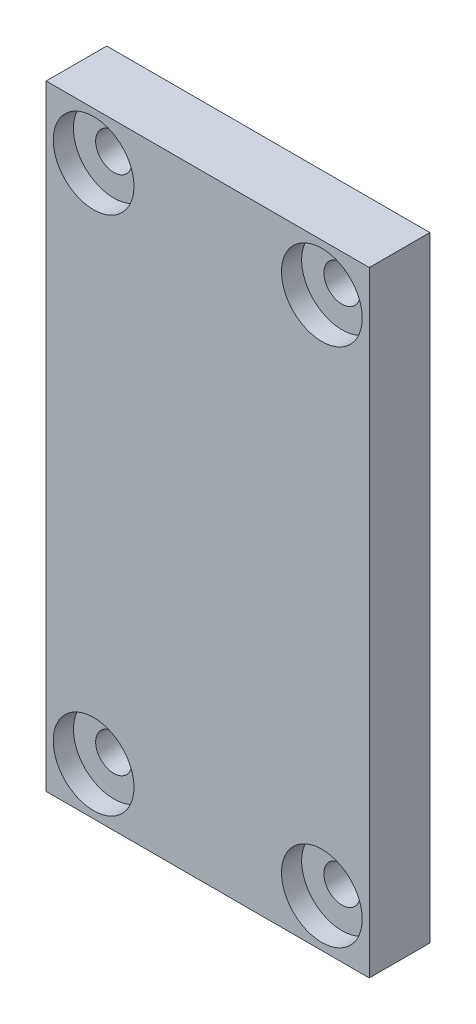
ISO-10303-21;
HEADER;
FILE_DESCRIPTION(('STEP AP214'),'2;1');
FILE_NAME('part.step','',(''),(''),'','','');
FILE_SCHEMA(('AUTOMOTIVE_DESIGN { 1 0 10303 214 1 1 1 1 }'));
ENDSEC;
DATA;
#1=APPLICATION_CONTEXT('core data for automotive mechanical design processes');
#2=APPLICATION_PROTOCOL_DEFINITION('international standard','automotive_design',2000,#1);
#3=PRODUCT_CONTEXT('',#1,'mechanical');
#4=PRODUCT('Part','Part','',(#3));
#5=PRODUCT_RELATED_PRODUCT_CATEGORY('part','',(#4));
#6=PRODUCT_DEFINITION_FORMATION('','',#4);
#7=PRODUCT_DEFINITION_CONTEXT('part definition',#1,'design');
#8=PRODUCT_DEFINITION('design','',#6,#7);
#9=PRODUCT_DEFINITION_SHAPE('','',#8);
#10=(LENGTH_UNIT() NAMED_UNIT(*) SI_UNIT(.MILLI.,.METRE.));
#11=(NAMED_UNIT(*) PLANE_ANGLE_UNIT() SI_UNIT($,.RADIAN.));
#12=(NAMED_UNIT(*) SI_UNIT($,.STERADIAN.) SOLID_ANGLE_UNIT());
#13=UNCERTAINTY_MEASURE_WITH_UNIT(LENGTH_MEASURE(1.E-05),#10,'distance_accuracy_value','');
#14=(GEOMETRIC_REPRESENTATION_CONTEXT(3) GLOBAL_UNCERTAINTY_ASSIGNED_CONTEXT((#13)) GLOBAL_UNIT_ASSIGNED_CONTEXT((#10,
#11,#12)) REPRESENTATION_CONTEXT('',''));
#15=CARTESIAN_POINT('',(0.,0.,0.));
#16=DIRECTION('',(0.,0.,1.));
#17=DIRECTION('',(1.,0.,0.));
#18=AXIS2_PLACEMENT_3D('',#15,#16,#17);
#19=CARTESIAN_POINT('',(11.9174159408387,12.8899999999994,3.));
#20=DIRECTION('',(0.,0.,-1.));
#21=DIRECTION('',(-1.,0.,0.));
#22=AXIS2_PLACEMENT_3D('',#19,#20,#21);
#23=CYLINDRICAL_SURFACE('',#22,0.899999977999999);
#24=CARTESIAN_POINT('',(11.9174159408387,12.8899999999994,0.));
#25=DIRECTION('',(0.,0.,1.));
#26=DIRECTION('',(1.,0.,0.));
#27=AXIS2_PLACEMENT_3D('',#24,#25,#26);
#28=CIRCLE('',#27,0.899999977999999);
#29=CARTESIAN_POINT('',(12.8174159188387,12.8899999999994,0.));
#30=VERTEX_POINT('',#29);
#31=EDGE_CURVE('E139',#30,#30,#28,.T.);
#32=ORIENTED_EDGE('',*,*,#31,.F.);
#33=EDGE_LOOP('',(#32));
#34=FACE_BOUND('',#33,.T.);
#35=CARTESIAN_POINT('',(11.9174159408387,12.8899999999994,2.));
#36=DIRECTION('',(0.,0.,1.));
#37=DIRECTION('',(1.,0.,0.));
#38=AXIS2_PLACEMENT_3D('',#35,#36,#37);
#39=CIRCLE('',#38,0.899999977999999);
#40=CARTESIAN_POINT('',(12.8174159188387,12.8899999999994,2.));
#41=VERTEX_POINT('',#40);
#42=EDGE_CURVE('E46',#41,#41,#39,.T.);
#43=ORIENTED_EDGE('',*,*,#42,.T.);
#44=EDGE_LOOP('',(#43));
#45=FACE_BOUND('',#44,.T.);
#46=ADVANCED_FACE('F42',(#34,#45),#23,.F.);
#47=CARTESIAN_POINT('',(23.2239221643566,-12.8900000000008,3.));
#48=DIRECTION('',(0.,0.,-1.));
#49=DIRECTION('',(-1.,0.,0.));
#50=AXIS2_PLACEMENT_3D('',#47,#48,#49);
#51=CYLINDRICAL_SURFACE('',#50,0.899999977999999);
#52=CARTESIAN_POINT('',(23.2239221643566,-12.8900000000008,0.));
#53=DIRECTION('',(0.,0.,1.));
#54=DIRECTION('',(1.,0.,0.));
#55=AXIS2_PLACEMENT_3D('',#52,#53,#54);
#56=CIRCLE('',#55,0.899999977999999);
#57=CARTESIAN_POINT('',(24.1239221423566,-12.8900000000008,0.));
#58=VERTEX_POINT('',#57);
#59=EDGE_CURVE('E135',#58,#58,#56,.T.);
#60=ORIENTED_EDGE('',*,*,#59,.F.);
#61=EDGE_LOOP('',(#60));
#62=FACE_BOUND('',#61,.T.);
#63=CARTESIAN_POINT('',(23.2239221643566,-12.8900000000008,2.));
#64=DIRECTION('',(0.,0.,1.));
#65=DIRECTION('',(1.,0.,0.));
#66=AXIS2_PLACEMENT_3D('',#63,#64,#65);
#67=CIRCLE('',#66,0.899999977999999);
#68=CARTESIAN_POINT('',(24.1239221423566,-12.8900000000008,2.));
#69=VERTEX_POINT('',#68);
#70=EDGE_CURVE('E164',#69,#69,#67,.T.);
#71=ORIENTED_EDGE('',*,*,#70,.T.);
#72=EDGE_LOOP('',(#71));
#73=FACE_BOUND('',#72,.T.);
#74=ADVANCED_FACE('F251',(#62,#73),#51,.F.);
#75=CARTESIAN_POINT('',(23.2239221643566,12.8899999999994,3.));
#76=DIRECTION('',(0.,0.,-1.));
#77=DIRECTION('',(-1.,0.,0.));
#78=AXIS2_PLACEMENT_3D('',#75,#76,#77);
#79=CYLINDRICAL_SURFACE('',#78,0.899999977999999);
#80=CARTESIAN_POINT('',(23.2239221643566,12.8899999999994,0.));
#81=DIRECTION('',(0.,0.,1.));
#82=DIRECTION('',(1.,0.,0.));
#83=AXIS2_PLACEMENT_3D('',#80,#81,#82);
#84=CIRCLE('',#83,0.899999977999999);
#85=CARTESIAN_POINT('',(24.1239221423566,12.8899999999994,0.));
#86=VERTEX_POINT('',#85);
#87=EDGE_CURVE('E132',#86,#86,#84,.T.);
#88=ORIENTED_EDGE('',*,*,#87,.F.);
#89=EDGE_LOOP('',(#88));
#90=FACE_BOUND('',#89,.T.);
#91=CARTESIAN_POINT('',(23.2239221643566,12.8899999999994,2.));
#92=DIRECTION('',(0.,0.,1.));
#93=DIRECTION('',(1.,0.,0.));
#94=AXIS2_PLACEMENT_3D('',#91,#92,#93);
#95=CIRCLE('',#94,0.899999977999999);
#96=CARTESIAN_POINT('',(24.1239221423566,12.8899999999994,2.));
#97=VERTEX_POINT('',#96);
#98=EDGE_CURVE('E160',#97,#97,#95,.T.);
#99=ORIENTED_EDGE('',*,*,#98,.T.);
#100=EDGE_LOOP('',(#99));
#101=FACE_BOUND('',#100,.T.);
#102=ADVANCED_FACE('F257',(#90,#101),#79,.F.);
#103=CARTESIAN_POINT('',(11.9174159408387,-12.8900000000008,3.));
#104=DIRECTION('',(0.,0.,-1.));
#105=DIRECTION('',(-1.,0.,0.));
#106=AXIS2_PLACEMENT_3D('',#103,#104,#105);
#107=CYLINDRICAL_SURFACE('',#106,0.899999977999999);
#108=CARTESIAN_POINT('',(11.9174159408387,-12.8900000000008,0.));
#109=DIRECTION('',(0.,0.,1.));
#110=DIRECTION('',(1.,0.,0.));
#111=AXIS2_PLACEMENT_3D('',#108,#109,#110);
#112=CIRCLE('',#111,0.899999977999999);
#113=CARTESIAN_POINT('',(12.8174159188387,-12.8900000000008,0.));
#114=VERTEX_POINT('',#113);
#115=EDGE_CURVE('E128',#114,#114,#112,.T.);
#116=ORIENTED_EDGE('',*,*,#115,.F.);
#117=EDGE_LOOP('',(#116));
#118=FACE_BOUND('',#117,.T.);
#119=CARTESIAN_POINT('',(11.9174159408387,-12.8900000000008,2.));
#120=DIRECTION('',(0.,0.,1.));
#121=DIRECTION('',(1.,0.,0.));
#122=AXIS2_PLACEMENT_3D('',#119,#120,#121);
#123=CIRCLE('',#122,0.899999977999999);
#124=CARTESIAN_POINT('',(12.8174159188387,-12.8900000000008,2.));
#125=VERTEX_POINT('',#124);
#126=EDGE_CURVE('E156',#125,#125,#123,.T.);
#127=ORIENTED_EDGE('',*,*,#126,.T.);
#128=EDGE_LOOP('',(#127));
#129=FACE_BOUND('',#128,.T.);
#130=ADVANCED_FACE('F44',(#118,#129),#107,.F.);
#131=CARTESIAN_POINT('',(25.5739221643566,0.,3.));
#132=DIRECTION('',(1.,0.,0.));
#133=DIRECTION('',(0.,0.,-1.));
#134=AXIS2_PLACEMENT_3D('',#131,#132,#133);
#135=PLANE('',#134);
#136=DIRECTION('',(0.,-1.,0.));
#137=VECTOR('',#136,1.);
#138=CARTESIAN_POINT('',(25.5739221643566,0.,0.));
#139=LINE('',#138,#137);
#140=CARTESIAN_POINT('',(25.5739221643566,15.2399999999994,0.));
#141=VERTEX_POINT('',#140);
#142=CARTESIAN_POINT('',(25.5739221643566,-15.2400000000008,0.));
#143=VERTEX_POINT('',#142);
#144=EDGE_CURVE('E143',#141,#143,#139,.T.);
#145=ORIENTED_EDGE('',*,*,#144,.F.);
#146=DIRECTION('',(0.,0.,-1.));
#147=VECTOR('',#146,1.);
#148=CARTESIAN_POINT('',(25.5739221643566,15.2399999999994,3.));
#149=LINE('',#148,#147);
#150=CARTESIAN_POINT('',(25.5739221643566,15.2399999999994,3.));
#151=VERTEX_POINT('',#150);
#152=EDGE_CURVE('E11',#151,#141,#149,.T.);
#153=ORIENTED_EDGE('',*,*,#152,.F.);
#154=DIRECTION('',(0.,-1.,0.));
#155=VECTOR('',#154,1.);
#156=CARTESIAN_POINT('',(25.5739221643566,0.,3.));
#157=LINE('',#156,#155);
#158=CARTESIAN_POINT('',(25.5739221643566,-15.2400000000008,3.));
#159=VERTEX_POINT('',#158);
#160=EDGE_CURVE('E117',#151,#159,#157,.T.);
#161=ORIENTED_EDGE('',*,*,#160,.T.);
#162=DIRECTION('',(0.,0.,-1.));
#163=VECTOR('',#162,1.);
#164=CARTESIAN_POINT('',(25.5739221643566,-15.2400000000008,3.));
#165=LINE('',#164,#163);
#166=EDGE_CURVE('E92',#159,#143,#165,.T.);
#167=ORIENTED_EDGE('',*,*,#166,.T.);
#168=EDGE_LOOP('',(#145,#153,#161,#167));
#169=FACE_BOUND('',#168,.T.);
#170=ADVANCED_FACE('F262',(#169),#135,.T.);
#171=CARTESIAN_POINT('',(0.,15.2399999999994,3.));
#172=DIRECTION('',(0.,1.,0.));
#173=DIRECTION('',(0.,0.,1.));
#174=AXIS2_PLACEMENT_3D('',#171,#172,#173);
#175=PLANE('',#174);
#176=DIRECTION('',(1.,0.,0.));
#177=VECTOR('',#176,1.);
#178=CARTESIAN_POINT('',(0.,15.2399999999994,0.));
#179=LINE('',#178,#177);
#180=CARTESIAN_POINT('',(9.56741594083871,15.2399999999994,0.));
#181=VERTEX_POINT('',#180);
#182=EDGE_CURVE('E105',#181,#141,#179,.T.);
#183=ORIENTED_EDGE('',*,*,#182,.F.);
#184=DIRECTION('',(0.,0.,-1.));
#185=VECTOR('',#184,1.);
#186=CARTESIAN_POINT('',(9.56741594083871,15.2399999999994,3.));
#187=LINE('',#186,#185);
#188=CARTESIAN_POINT('',(9.56741594083871,15.2399999999994,3.));
#189=VERTEX_POINT('',#188);
#190=EDGE_CURVE('E53',#189,#181,#187,.T.);
#191=ORIENTED_EDGE('',*,*,#190,.F.);
#192=DIRECTION('',(1.,0.,0.));
#193=VECTOR('',#192,1.);
#194=CARTESIAN_POINT('',(0.,15.2399999999994,3.));
#195=LINE('',#194,#193);
#196=EDGE_CURVE('E103',#189,#151,#195,.T.);
#197=ORIENTED_EDGE('',*,*,#196,.T.);
#198=ORIENTED_EDGE('',*,*,#152,.T.);
#199=EDGE_LOOP('',(#183,#191,#197,#198));
#200=FACE_BOUND('',#199,.T.);
#201=ADVANCED_FACE('F101',(#200),#175,.T.);
#202=CARTESIAN_POINT('',(9.56741594083871,0.,3.));
#203=DIRECTION('',(1.,0.,0.));
#204=DIRECTION('',(0.,0.,-1.));
#205=AXIS2_PLACEMENT_3D('',#202,#203,#204);
#206=PLANE('',#205);
#207=DIRECTION('',(0.,-1.,0.));
#208=VECTOR('',#207,1.);
#209=CARTESIAN_POINT('',(9.56741594083871,0.,0.));
#210=LINE('',#209,#208);
#211=CARTESIAN_POINT('',(9.56741594083871,-15.2400000000008,0.));
#212=VERTEX_POINT('',#211);
#213=EDGE_CURVE('E147',#181,#212,#210,.T.);
#214=ORIENTED_EDGE('',*,*,#213,.T.);
#215=DIRECTION('',(0.,0.,-1.));
#216=VECTOR('',#215,1.);
#217=CARTESIAN_POINT('',(9.56741594083871,-15.2400000000008,3.));
#218=LINE('',#217,#216);
#219=CARTESIAN_POINT('',(9.56741594083871,-15.2400000000008,3.));
#220=VERTEX_POINT('',#219);
#221=EDGE_CURVE('E109',#220,#212,#218,.T.);
#222=ORIENTED_EDGE('',*,*,#221,.F.);
#223=DIRECTION('',(0.,-1.,0.));
#224=VECTOR('',#223,1.);
#225=CARTESIAN_POINT('',(9.56741594083871,0.,3.));
#226=LINE('',#225,#224);
#227=EDGE_CURVE('E112',#189,#220,#226,.T.);
#228=ORIENTED_EDGE('',*,*,#227,.F.);
#229=ORIENTED_EDGE('',*,*,#190,.T.);
#230=EDGE_LOOP('',(#214,#222,#228,#229));
#231=FACE_BOUND('',#230,.T.);
#232=ADVANCED_FACE('F113',(#231),#206,.F.);
#233=CARTESIAN_POINT('',(0.,-15.2400000000008,3.));
#234=DIRECTION('',(0.,1.,0.));
#235=DIRECTION('',(0.,0.,1.));
#236=AXIS2_PLACEMENT_3D('',#233,#234,#235);
#237=PLANE('',#236);
#238=DIRECTION('',(1.,0.,0.));
#239=VECTOR('',#238,1.);
#240=CARTESIAN_POINT('',(0.,-15.2400000000008,0.));
#241=LINE('',#240,#239);
#242=EDGE_CURVE('E84',#212,#143,#241,.T.);
#243=ORIENTED_EDGE('',*,*,#242,.T.);
#244=ORIENTED_EDGE('',*,*,#166,.F.);
#245=DIRECTION('',(1.,0.,0.));
#246=VECTOR('',#245,1.);
#247=CARTESIAN_POINT('',(0.,-15.2400000000008,3.));
#248=LINE('',#247,#246);
#249=EDGE_CURVE('E65',#220,#159,#248,.T.);
#250=ORIENTED_EDGE('',*,*,#249,.F.);
#251=ORIENTED_EDGE('',*,*,#221,.T.);
#252=EDGE_LOOP('',(#243,#244,#250,#251));
#253=FACE_BOUND('',#252,.T.);
#254=ADVANCED_FACE('F229',(#253),#237,.F.);
#255=CARTESIAN_POINT('',(0.,0.,3.));
#256=DIRECTION('',(0.,0.,1.));
#257=DIRECTION('',(1.,0.,0.));
#258=AXIS2_PLACEMENT_3D('',#255,#256,#257);
#259=PLANE('',#258);
#260=CARTESIAN_POINT('',(11.9174159408387,12.8899999999994,3.));
#261=DIRECTION('',(0.,0.,1.));
#262=DIRECTION('',(1.,0.,0.));
#263=AXIS2_PLACEMENT_3D('',#260,#261,#262);
#264=CIRCLE('',#263,2.00000006399992);
#265=CARTESIAN_POINT('',(13.9174160048386,12.8899999999994,3.));
#266=VERTEX_POINT('',#265);
#267=EDGE_CURVE('E187',#266,#266,#264,.T.);
#268=ORIENTED_EDGE('',*,*,#267,.F.);
#269=EDGE_LOOP('',(#268));
#270=FACE_BOUND('',#269,.T.);
#271=CARTESIAN_POINT('',(11.9174159408387,-12.8900000000008,3.));
#272=DIRECTION('',(0.,0.,1.));
#273=DIRECTION('',(1.,0.,0.));
#274=AXIS2_PLACEMENT_3D('',#271,#272,#273);
#275=CIRCLE('',#274,2.00000006399992);
#276=CARTESIAN_POINT('',(13.9174160048386,-12.8900000000008,3.));
#277=VERTEX_POINT('',#276);
#278=EDGE_CURVE('E186',#277,#277,#275,.T.);
#279=ORIENTED_EDGE('',*,*,#278,.F.);
#280=EDGE_LOOP('',(#279));
#281=FACE_BOUND('',#280,.T.);
#282=CARTESIAN_POINT('',(23.2239221643566,-12.8900000000008,3.));
#283=DIRECTION('',(0.,0.,1.));
#284=DIRECTION('',(1.,0.,0.));
#285=AXIS2_PLACEMENT_3D('',#282,#283,#284);
#286=CIRCLE('',#285,2.00000006399992);
#287=CARTESIAN_POINT('',(25.2239222283565,-12.8900000000008,3.));
#288=VERTEX_POINT('',#287);
#289=EDGE_CURVE('E207',#288,#288,#286,.T.);
#290=ORIENTED_EDGE('',*,*,#289,.F.);
#291=EDGE_LOOP('',(#290));
#292=FACE_BOUND('',#291,.T.);
#293=CARTESIAN_POINT('',(23.2239221643566,12.8899999999994,3.));
#294=DIRECTION('',(0.,0.,1.));
#295=DIRECTION('',(1.,0.,0.));
#296=AXIS2_PLACEMENT_3D('',#293,#294,#295);
#297=CIRCLE('',#296,2.00000006399992);
#298=CARTESIAN_POINT('',(25.2239222283565,12.8899999999994,3.));
#299=VERTEX_POINT('',#298);
#300=EDGE_CURVE('E200',#299,#299,#297,.T.);
#301=ORIENTED_EDGE('',*,*,#300,.F.);
#302=EDGE_LOOP('',(#301));
#303=FACE_BOUND('',#302,.T.);
#304=ORIENTED_EDGE('',*,*,#160,.F.);
#305=ORIENTED_EDGE('',*,*,#196,.F.);
#306=ORIENTED_EDGE('',*,*,#227,.T.);
#307=ORIENTED_EDGE('',*,*,#249,.T.);
#308=EDGE_LOOP('',(#304,#305,#306,#307));
#309=FACE_BOUND('',#308,.T.);
#310=ADVANCED_FACE('F116',(#270,#281,#292,#303,#309),#259,.T.);
#311=CARTESIAN_POINT('',(0.,0.,0.));
#312=DIRECTION('',(0.,0.,1.));
#313=DIRECTION('',(1.,0.,0.));
#314=AXIS2_PLACEMENT_3D('',#311,#312,#313);
#315=PLANE('',#314);
#316=ORIENTED_EDGE('',*,*,#115,.T.);
#317=EDGE_LOOP('',(#316));
#318=FACE_BOUND('',#317,.T.);
#319=ORIENTED_EDGE('',*,*,#87,.T.);
#320=EDGE_LOOP('',(#319));
#321=FACE_BOUND('',#320,.T.);
#322=ORIENTED_EDGE('',*,*,#59,.T.);
#323=EDGE_LOOP('',(#322));
#324=FACE_BOUND('',#323,.T.);
#325=ORIENTED_EDGE('',*,*,#31,.T.);
#326=EDGE_LOOP('',(#325));
#327=FACE_BOUND('',#326,.T.);
#328=ORIENTED_EDGE('',*,*,#144,.T.);
#329=ORIENTED_EDGE('',*,*,#242,.F.);
#330=ORIENTED_EDGE('',*,*,#213,.F.);
#331=ORIENTED_EDGE('',*,*,#182,.T.);
#332=EDGE_LOOP('',(#328,#329,#330,#331));
#333=FACE_BOUND('',#332,.T.);
#334=ADVANCED_FACE('F228',(#318,#321,#324,#327,#333),#315,.F.);
#335=CARTESIAN_POINT('',(23.2239221643566,12.8899999999994,2.));
#336=DIRECTION('',(0.,0.,1.));
#337=DIRECTION('',(1.,0.,0.));
#338=AXIS2_PLACEMENT_3D('',#335,#336,#337);
#339=CYLINDRICAL_SURFACE('',#338,2.00000006399992);
#340=CARTESIAN_POINT('',(23.2239221643566,12.8899999999994,2.));
#341=DIRECTION('',(0.,0.,1.));
#342=DIRECTION('',(1.,0.,0.));
#343=AXIS2_PLACEMENT_3D('',#340,#341,#342);
#344=CIRCLE('',#343,2.00000006399992);
#345=CARTESIAN_POINT('',(25.2239222283565,12.8899999999994,2.));
#346=VERTEX_POINT('',#345);
#347=EDGE_CURVE('E161',#346,#346,#344,.T.);
#348=ORIENTED_EDGE('',*,*,#347,.F.);
#349=EDGE_LOOP('',(#348));
#350=FACE_BOUND('',#349,.T.);
#351=ORIENTED_EDGE('',*,*,#300,.T.);
#352=EDGE_LOOP('',(#351));
#353=FACE_BOUND('',#352,.T.);
#354=ADVANCED_FACE('F246',(#350,#353),#339,.F.);
#355=CARTESIAN_POINT('',(23.2239221643566,12.8899999999994,2.));
#356=DIRECTION('',(0.,0.,1.));
#357=DIRECTION('',(1.,0.,0.));
#358=AXIS2_PLACEMENT_3D('',#355,#356,#357);
#359=PLANE('',#358);
#360=ORIENTED_EDGE('',*,*,#98,.F.);
#361=EDGE_LOOP('',(#360));
#362=FACE_BOUND('',#361,.T.);
#363=ORIENTED_EDGE('',*,*,#347,.T.);
#364=EDGE_LOOP('',(#363));
#365=FACE_BOUND('',#364,.T.);
#366=ADVANCED_FACE('F237',(#362,#365),#359,.T.);
#367=CARTESIAN_POINT('',(23.2239221643566,-12.8900000000008,2.));
#368=DIRECTION('',(0.,0.,1.));
#369=DIRECTION('',(1.,0.,0.));
#370=AXIS2_PLACEMENT_3D('',#367,#368,#369);
#371=CYLINDRICAL_SURFACE('',#370,2.00000006399992);
#372=CARTESIAN_POINT('',(23.2239221643566,-12.8900000000008,2.));
#373=DIRECTION('',(0.,0.,1.));
#374=DIRECTION('',(1.,0.,0.));
#375=AXIS2_PLACEMENT_3D('',#372,#373,#374);
#376=CIRCLE('',#375,2.00000006399992);
#377=CARTESIAN_POINT('',(25.2239222283565,-12.8900000000008,2.));
#378=VERTEX_POINT('',#377);
#379=EDGE_CURVE('E203',#378,#378,#376,.T.);
#380=ORIENTED_EDGE('',*,*,#379,.F.);
#381=EDGE_LOOP('',(#380));
#382=FACE_BOUND('',#381,.T.);
#383=ORIENTED_EDGE('',*,*,#289,.T.);
#384=EDGE_LOOP('',(#383));
#385=FACE_BOUND('',#384,.T.);
#386=ADVANCED_FACE('F235',(#382,#385),#371,.F.);
#387=CARTESIAN_POINT('',(23.2239221643566,-12.8900000000008,2.));
#388=DIRECTION('',(0.,0.,1.));
#389=DIRECTION('',(1.,0.,0.));
#390=AXIS2_PLACEMENT_3D('',#387,#388,#389);
#391=PLANE('',#390);
#392=ORIENTED_EDGE('',*,*,#70,.F.);
#393=EDGE_LOOP('',(#392));
#394=FACE_BOUND('',#393,.T.);
#395=ORIENTED_EDGE('',*,*,#379,.T.);
#396=EDGE_LOOP('',(#395));
#397=FACE_BOUND('',#396,.T.);
#398=ADVANCED_FACE('F222',(#394,#397),#391,.T.);
#399=CARTESIAN_POINT('',(11.9174159408387,-12.8900000000008,2.));
#400=DIRECTION('',(0.,0.,1.));
#401=DIRECTION('',(1.,0.,0.));
#402=AXIS2_PLACEMENT_3D('',#399,#400,#401);
#403=CYLINDRICAL_SURFACE('',#402,2.00000006399992);
#404=CARTESIAN_POINT('',(11.9174159408387,-12.8900000000008,2.));
#405=DIRECTION('',(0.,0.,1.));
#406=DIRECTION('',(1.,0.,0.));
#407=AXIS2_PLACEMENT_3D('',#404,#405,#406);
#408=CIRCLE('',#407,2.00000006399992);
#409=CARTESIAN_POINT('',(13.9174160048386,-12.8900000000008,2.));
#410=VERTEX_POINT('',#409);
#411=EDGE_CURVE('E192',#410,#410,#408,.T.);
#412=ORIENTED_EDGE('',*,*,#411,.F.);
#413=EDGE_LOOP('',(#412));
#414=FACE_BOUND('',#413,.T.);
#415=ORIENTED_EDGE('',*,*,#278,.T.);
#416=EDGE_LOOP('',(#415));
#417=FACE_BOUND('',#416,.T.);
#418=ADVANCED_FACE('F219',(#414,#417),#403,.F.);
#419=CARTESIAN_POINT('',(11.9174159408387,-12.8900000000008,2.));
#420=DIRECTION('',(0.,0.,1.));
#421=DIRECTION('',(1.,0.,0.));
#422=AXIS2_PLACEMENT_3D('',#419,#420,#421);
#423=PLANE('',#422);
#424=ORIENTED_EDGE('',*,*,#126,.F.);
#425=EDGE_LOOP('',(#424));
#426=FACE_BOUND('',#425,.T.);
#427=ORIENTED_EDGE('',*,*,#411,.T.);
#428=EDGE_LOOP('',(#427));
#429=FACE_BOUND('',#428,.T.);
#430=ADVANCED_FACE('F217',(#426,#429),#423,.T.);
#431=CARTESIAN_POINT('',(11.9174159408387,12.8899999999994,2.));
#432=DIRECTION('',(0.,0.,1.));
#433=DIRECTION('',(1.,0.,0.));
#434=AXIS2_PLACEMENT_3D('',#431,#432,#433);
#435=CYLINDRICAL_SURFACE('',#434,2.00000006399992);
#436=CARTESIAN_POINT('',(11.9174159408387,12.8899999999994,2.));
#437=DIRECTION('',(0.,0.,1.));
#438=DIRECTION('',(1.,0.,0.));
#439=AXIS2_PLACEMENT_3D('',#436,#437,#438);
#440=CIRCLE('',#439,2.00000006399992);
#441=CARTESIAN_POINT('',(13.9174160048386,12.8899999999994,2.));
#442=VERTEX_POINT('',#441);
#443=EDGE_CURVE('E184',#442,#442,#440,.T.);
#444=ORIENTED_EDGE('',*,*,#443,.F.);
#445=EDGE_LOOP('',(#444));
#446=FACE_BOUND('',#445,.T.);
#447=ORIENTED_EDGE('',*,*,#267,.T.);
#448=EDGE_LOOP('',(#447));
#449=FACE_BOUND('',#448,.T.);
#450=ADVANCED_FACE('F180',(#446,#449),#435,.F.);
#451=CARTESIAN_POINT('',(11.9174159408387,12.8899999999994,2.));
#452=DIRECTION('',(0.,0.,1.));
#453=DIRECTION('',(1.,0.,0.));
#454=AXIS2_PLACEMENT_3D('',#451,#452,#453);
#455=PLANE('',#454);
#456=ORIENTED_EDGE('',*,*,#42,.F.);
#457=EDGE_LOOP('',(#456));
#458=FACE_BOUND('',#457,.T.);
#459=ORIENTED_EDGE('',*,*,#443,.T.);
#460=EDGE_LOOP('',(#459));
#461=FACE_BOUND('',#460,.T.);
#462=ADVANCED_FACE('F177',(#458,#461),#455,.T.);
#463=CLOSED_SHELL('',(#46,#74,#102,#130,#170,#201,#232,#254,#310,#334,#354,#366,#386,#398,#418,
#430,#450,#462));
#464=MANIFOLD_SOLID_BREP('B2',#463);
#465=ADVANCED_BREP_SHAPE_REPRESENTATION('',(#18,#464),#14);
#466=SHAPE_DEFINITION_REPRESENTATION(#9,#465);
ENDSEC;
END-ISO-10303-21;
